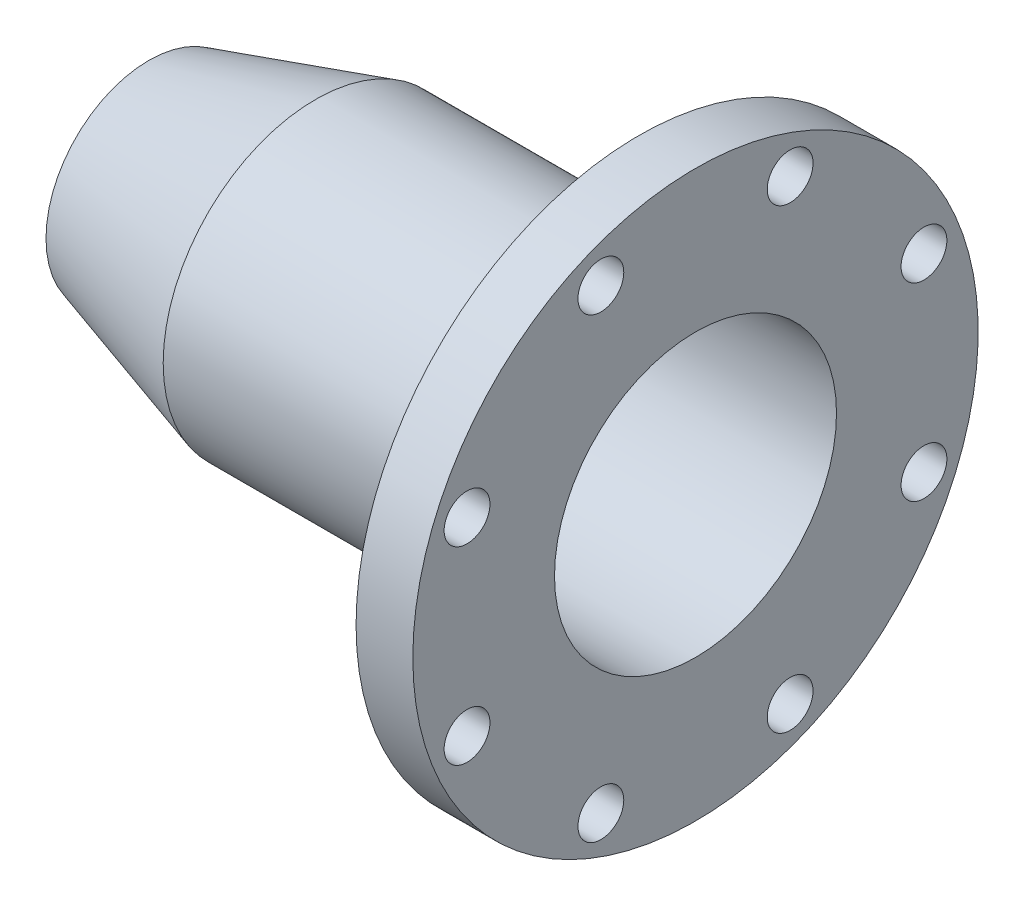
ISO-10303-21;
HEADER;
FILE_DESCRIPTION(('STEP AP214'),'2;1');
FILE_NAME('part.step','',(''),(''),'','','');
FILE_SCHEMA(('AUTOMOTIVE_DESIGN { 1 0 10303 214 1 1 1 1 }'));
ENDSEC;
DATA;
#1=APPLICATION_CONTEXT('core data for automotive mechanical design processes');
#2=APPLICATION_PROTOCOL_DEFINITION('international standard','automotive_design',2000,#1);
#3=PRODUCT_CONTEXT('',#1,'mechanical');
#4=PRODUCT('Part','Part','',(#3));
#5=PRODUCT_RELATED_PRODUCT_CATEGORY('part','',(#4));
#6=PRODUCT_DEFINITION_FORMATION('','',#4);
#7=PRODUCT_DEFINITION_CONTEXT('part definition',#1,'design');
#8=PRODUCT_DEFINITION('design','',#6,#7);
#9=PRODUCT_DEFINITION_SHAPE('','',#8);
#10=(LENGTH_UNIT() NAMED_UNIT(*) SI_UNIT(.MILLI.,.METRE.));
#11=(NAMED_UNIT(*) PLANE_ANGLE_UNIT() SI_UNIT($,.RADIAN.));
#12=(NAMED_UNIT(*) SI_UNIT($,.STERADIAN.) SOLID_ANGLE_UNIT());
#13=UNCERTAINTY_MEASURE_WITH_UNIT(LENGTH_MEASURE(1.E-05),#10,'distance_accuracy_value','');
#14=(GEOMETRIC_REPRESENTATION_CONTEXT(3) GLOBAL_UNCERTAINTY_ASSIGNED_CONTEXT((#13)) GLOBAL_UNIT_ASSIGNED_CONTEXT((#10,
#11,#12)) REPRESENTATION_CONTEXT('',''));
#15=CARTESIAN_POINT('',(0.,0.,0.));
#16=DIRECTION('',(0.,0.,1.));
#17=DIRECTION('',(1.,0.,0.));
#18=AXIS2_PLACEMENT_3D('',#15,#16,#17);
#19=CARTESIAN_POINT('',(0.,0.,0.));
#20=DIRECTION('',(-1.,0.,0.));
#21=DIRECTION('',(0.,0.,1.));
#22=AXIS2_PLACEMENT_3D('',#19,#20,#21);
#23=CYLINDRICAL_SURFACE('',#22,74.295);
#24=CARTESIAN_POINT('',(239.01,0.,0.));
#25=DIRECTION('',(-1.,0.,0.));
#26=DIRECTION('',(0.,0.,1.));
#27=AXIS2_PLACEMENT_3D('',#24,#25,#26);
#28=CIRCLE('',#27,74.295);
#29=CARTESIAN_POINT('',(239.01,0.,74.295));
#30=VERTEX_POINT('',#29);
#31=EDGE_CURVE('E98',#30,#30,#28,.T.);
#32=ORIENTED_EDGE('',*,*,#31,.T.);
#33=EDGE_LOOP('',(#32));
#34=FACE_BOUND('',#33,.T.);
#35=CARTESIAN_POINT('',(81.28,0.,0.));
#36=DIRECTION('',(-1.,0.,0.));
#37=DIRECTION('',(0.,0.,1.));
#38=AXIS2_PLACEMENT_3D('',#35,#36,#37);
#39=CIRCLE('',#38,74.295);
#40=CARTESIAN_POINT('',(81.28,0.,74.295));
#41=VERTEX_POINT('',#40);
#42=EDGE_CURVE('E10',#41,#41,#39,.T.);
#43=ORIENTED_EDGE('',*,*,#42,.F.);
#44=EDGE_LOOP('',(#43));
#45=FACE_BOUND('',#44,.T.);
#46=ADVANCED_FACE('F39',(#34,#45),#23,.T.);
#47=CARTESIAN_POINT('',(81.28,0.,0.));
#48=DIRECTION('',(1.,0.,0.));
#49=DIRECTION('',(0.,0.,-1.));
#50=AXIS2_PLACEMENT_3D('',#47,#48,#49);
#51=CONICAL_SURFACE('',#50,74.295,0.288340484549115);
#52=CARTESIAN_POINT('',(0.,0.,0.));
#53=DIRECTION('',(-1.,0.,0.));
#54=DIRECTION('',(0.,0.,1.));
#55=AXIS2_PLACEMENT_3D('',#52,#53,#54);
#56=CIRCLE('',#55,50.1868331198608);
#57=CARTESIAN_POINT('',(0.,0.,50.1868331198608));
#58=VERTEX_POINT('',#57);
#59=EDGE_CURVE('E47',#58,#58,#56,.T.);
#60=ORIENTED_EDGE('',*,*,#59,.F.);
#61=EDGE_LOOP('',(#60));
#62=FACE_BOUND('',#61,.T.);
#63=ORIENTED_EDGE('',*,*,#42,.T.);
#64=EDGE_LOOP('',(#63));
#65=FACE_BOUND('',#64,.T.);
#66=ADVANCED_FACE('F127',(#62,#65),#51,.T.);
#67=CARTESIAN_POINT('',(0.,0.,0.));
#68=DIRECTION('',(1.,0.,0.));
#69=DIRECTION('',(0.,0.,-1.));
#70=AXIS2_PLACEMENT_3D('',#67,#68,#69);
#71=PLANE('',#70);
#72=CARTESIAN_POINT('',(0.,0.,0.));
#73=DIRECTION('',(-1.,0.,0.));
#74=DIRECTION('',(0.,0.,1.));
#75=AXIS2_PLACEMENT_3D('',#72,#73,#74);
#76=CIRCLE('',#75,44.45);
#77=CARTESIAN_POINT('',(0.,0.,44.45));
#78=VERTEX_POINT('',#77);
#79=EDGE_CURVE('E53',#78,#78,#76,.T.);
#80=ORIENTED_EDGE('',*,*,#79,.F.);
#81=EDGE_LOOP('',(#80));
#82=FACE_BOUND('',#81,.T.);
#83=ORIENTED_EDGE('',*,*,#59,.T.);
#84=EDGE_LOOP('',(#83));
#85=FACE_BOUND('',#84,.T.);
#86=ADVANCED_FACE('F124',(#82,#85),#71,.F.);
#87=CARTESIAN_POINT('',(82.0784761378992,0.,0.));
#88=DIRECTION('',(1.,0.,0.));
#89=DIRECTION('',(0.,0.,-1.));
#90=AXIS2_PLACEMENT_3D('',#87,#88,#89);
#91=CONICAL_SURFACE('',#90,68.795,0.288340484549115);
#92=ORIENTED_EDGE('',*,*,#79,.T.);
#93=EDGE_LOOP('',(#92));
#94=FACE_BOUND('',#93,.T.);
#95=CARTESIAN_POINT('',(82.0784761378992,0.,0.));
#96=DIRECTION('',(-1.,0.,0.));
#97=DIRECTION('',(0.,0.,1.));
#98=AXIS2_PLACEMENT_3D('',#95,#96,#97);
#99=CIRCLE('',#98,68.795);
#100=CARTESIAN_POINT('',(82.0784761378992,0.,68.795));
#101=VERTEX_POINT('',#100);
#102=EDGE_CURVE('E114',#101,#101,#99,.T.);
#103=ORIENTED_EDGE('',*,*,#102,.F.);
#104=EDGE_LOOP('',(#103));
#105=FACE_BOUND('',#104,.T.);
#106=ADVANCED_FACE('F121',(#94,#105),#91,.F.);
#107=CARTESIAN_POINT('',(0.,0.,0.));
#108=DIRECTION('',(-1.,0.,0.));
#109=DIRECTION('',(0.,0.,1.));
#110=AXIS2_PLACEMENT_3D('',#107,#108,#109);
#111=CYLINDRICAL_SURFACE('',#110,68.795);
#112=ORIENTED_EDGE('',*,*,#102,.T.);
#113=EDGE_LOOP('',(#112));
#114=FACE_BOUND('',#113,.T.);
#115=CARTESIAN_POINT('',(266.7,0.,0.));
#116=DIRECTION('',(-1.,0.,0.));
#117=DIRECTION('',(0.,0.,1.));
#118=AXIS2_PLACEMENT_3D('',#115,#116,#117);
#119=CIRCLE('',#118,68.795);
#120=CARTESIAN_POINT('',(266.7,0.,68.795));
#121=VERTEX_POINT('',#120);
#122=EDGE_CURVE('E110',#121,#121,#119,.T.);
#123=ORIENTED_EDGE('',*,*,#122,.F.);
#124=EDGE_LOOP('',(#123));
#125=FACE_BOUND('',#124,.T.);
#126=ADVANCED_FACE('F139',(#114,#125),#111,.F.);
#127=CARTESIAN_POINT('',(266.7,2.141746695606E-13,0.));
#128=DIRECTION('',(-1.,0.,0.));
#129=DIRECTION('',(0.,0.,1.));
#130=AXIS2_PLACEMENT_3D('',#127,#128,#129);
#131=PLANE('',#130);
#132=CARTESIAN_POINT('',(266.7,46.1707561148491,111.466065597486));
#133=DIRECTION('',(1.,0.,0.));
#134=DIRECTION('',(0.,0.,-1.));
#135=AXIS2_PLACEMENT_3D('',#132,#133,#134);
#136=CIRCLE('',#135,11.176);
#137=CARTESIAN_POINT('',(266.7,46.1707561148491,100.290065597486));
#138=VERTEX_POINT('',#137);
#139=EDGE_CURVE('E190',#138,#138,#136,.T.);
#140=ORIENTED_EDGE('',*,*,#139,.F.);
#141=EDGE_LOOP('',(#140));
#142=FACE_BOUND('',#141,.T.);
#143=CARTESIAN_POINT('',(266.7,-46.1707561148473,111.466065597487));
#144=DIRECTION('',(1.,0.,0.));
#145=DIRECTION('',(0.,0.,-1.));
#146=AXIS2_PLACEMENT_3D('',#143,#144,#145);
#147=CIRCLE('',#146,11.176);
#148=CARTESIAN_POINT('',(266.7,-46.1707561148473,100.290065597487));
#149=VERTEX_POINT('',#148);
#150=EDGE_CURVE('E195',#149,#149,#147,.T.);
#151=ORIENTED_EDGE('',*,*,#150,.F.);
#152=EDGE_LOOP('',(#151));
#153=FACE_BOUND('',#152,.T.);
#154=CARTESIAN_POINT('',(266.7,-111.466065597486,46.1707561148487));
#155=DIRECTION('',(1.,0.,0.));
#156=DIRECTION('',(0.,0.,-1.));
#157=AXIS2_PLACEMENT_3D('',#154,#155,#156);
#158=CIRCLE('',#157,11.176);
#159=CARTESIAN_POINT('',(266.7,-111.466065597486,34.9947561148488));
#160=VERTEX_POINT('',#159);
#161=EDGE_CURVE('E207',#160,#160,#158,.T.);
#162=ORIENTED_EDGE('',*,*,#161,.F.);
#163=EDGE_LOOP('',(#162));
#164=FACE_BOUND('',#163,.T.);
#165=CARTESIAN_POINT('',(266.7,-111.466065597487,-46.1707561148476));
#166=DIRECTION('',(1.,0.,0.));
#167=DIRECTION('',(0.,0.,-1.));
#168=AXIS2_PLACEMENT_3D('',#165,#166,#167);
#169=CIRCLE('',#168,11.176);
#170=CARTESIAN_POINT('',(266.7,-111.466065597487,-57.3467561148475));
#171=VERTEX_POINT('',#170);
#172=EDGE_CURVE('E84',#171,#171,#169,.T.);
#173=ORIENTED_EDGE('',*,*,#172,.F.);
#174=EDGE_LOOP('',(#173));
#175=FACE_BOUND('',#174,.T.);
#176=CARTESIAN_POINT('',(266.7,-46.1707561148484,-111.466065597487));
#177=DIRECTION('',(1.,0.,0.));
#178=DIRECTION('',(0.,0.,-1.));
#179=AXIS2_PLACEMENT_3D('',#176,#177,#178);
#180=CIRCLE('',#179,11.176);
#181=CARTESIAN_POINT('',(266.7,-46.1707561148484,-122.642065597487));
#182=VERTEX_POINT('',#181);
#183=EDGE_CURVE('E70',#182,#182,#180,.T.);
#184=ORIENTED_EDGE('',*,*,#183,.F.);
#185=EDGE_LOOP('',(#184));
#186=FACE_BOUND('',#185,.T.);
#187=CARTESIAN_POINT('',(266.7,46.1707561148479,-111.466065597487));
#188=DIRECTION('',(1.,0.,0.));
#189=DIRECTION('',(0.,0.,-1.));
#190=AXIS2_PLACEMENT_3D('',#187,#188,#189);
#191=CIRCLE('',#190,11.176);
#192=CARTESIAN_POINT('',(266.7,46.1707561148479,-122.642065597487));
#193=VERTEX_POINT('',#192);
#194=EDGE_CURVE('E66',#193,#193,#191,.T.);
#195=ORIENTED_EDGE('',*,*,#194,.F.);
#196=EDGE_LOOP('',(#195));
#197=FACE_BOUND('',#196,.T.);
#198=CARTESIAN_POINT('',(266.7,111.466065597487,-46.1707561148481));
#199=DIRECTION('',(1.,0.,0.));
#200=DIRECTION('',(0.,0.,-1.));
#201=AXIS2_PLACEMENT_3D('',#198,#199,#200);
#202=CIRCLE('',#201,11.176);
#203=CARTESIAN_POINT('',(266.7,111.466065597487,-57.3467561148481));
#204=VERTEX_POINT('',#203);
#205=EDGE_CURVE('E62',#204,#204,#202,.T.);
#206=ORIENTED_EDGE('',*,*,#205,.F.);
#207=EDGE_LOOP('',(#206));
#208=FACE_BOUND('',#207,.T.);
#209=CARTESIAN_POINT('',(266.7,111.466065597487,46.1707561148482));
#210=DIRECTION('',(1.,0.,0.));
#211=DIRECTION('',(0.,0.,-1.));
#212=AXIS2_PLACEMENT_3D('',#209,#210,#211);
#213=CIRCLE('',#212,11.176);
#214=CARTESIAN_POINT('',(266.7,111.466065597487,34.9947561148482));
#215=VERTEX_POINT('',#214);
#216=EDGE_CURVE('E61',#215,#215,#213,.T.);
#217=ORIENTED_EDGE('',*,*,#216,.F.);
#218=EDGE_LOOP('',(#217));
#219=FACE_BOUND('',#218,.T.);
#220=CARTESIAN_POINT('',(266.7,0.,0.));
#221=DIRECTION('',(-1.,0.,0.));
#222=DIRECTION('',(0.,0.,1.));
#223=AXIS2_PLACEMENT_3D('',#220,#221,#222);
#224=CIRCLE('',#223,137.92);
#225=CARTESIAN_POINT('',(266.7,0.,137.92));
#226=VERTEX_POINT('',#225);
#227=EDGE_CURVE('E106',#226,#226,#224,.T.);
#228=ORIENTED_EDGE('',*,*,#227,.F.);
#229=EDGE_LOOP('',(#228));
#230=FACE_BOUND('',#229,.T.);
#231=ORIENTED_EDGE('',*,*,#122,.T.);
#232=EDGE_LOOP('',(#231));
#233=FACE_BOUND('',#232,.T.);
#234=ADVANCED_FACE('F142',(#142,#153,#164,#175,#186,#197,#208,#219,#230,#233),#131,.F.);
#235=CARTESIAN_POINT('',(0.,0.,0.));
#236=DIRECTION('',(-1.,0.,0.));
#237=DIRECTION('',(0.,0.,1.));
#238=AXIS2_PLACEMENT_3D('',#235,#236,#237);
#239=CYLINDRICAL_SURFACE('',#238,137.92);
#240=CARTESIAN_POINT('',(239.01,0.,0.));
#241=DIRECTION('',(-1.,0.,0.));
#242=DIRECTION('',(0.,0.,1.));
#243=AXIS2_PLACEMENT_3D('',#240,#241,#242);
#244=CIRCLE('',#243,137.92);
#245=CARTESIAN_POINT('',(239.01,0.,137.92));
#246=VERTEX_POINT('',#245);
#247=EDGE_CURVE('E102',#246,#246,#244,.T.);
#248=ORIENTED_EDGE('',*,*,#247,.F.);
#249=EDGE_LOOP('',(#248));
#250=FACE_BOUND('',#249,.T.);
#251=ORIENTED_EDGE('',*,*,#227,.T.);
#252=EDGE_LOOP('',(#251));
#253=FACE_BOUND('',#252,.T.);
#254=ADVANCED_FACE('F146',(#250,#253),#239,.T.);
#255=CARTESIAN_POINT('',(239.01,1.04264992186899E-13,0.));
#256=DIRECTION('',(1.,0.,0.));
#257=DIRECTION('',(0.,0.,-1.));
#258=AXIS2_PLACEMENT_3D('',#255,#256,#257);
#259=PLANE('',#258);
#260=CARTESIAN_POINT('',(239.01,46.1707561148491,111.466065597486));
#261=DIRECTION('',(1.,0.,0.));
#262=DIRECTION('',(0.,0.,-1.));
#263=AXIS2_PLACEMENT_3D('',#260,#261,#262);
#264=CIRCLE('',#263,11.176);
#265=CARTESIAN_POINT('',(239.01,46.1707561148491,100.290065597486));
#266=VERTEX_POINT('',#265);
#267=EDGE_CURVE('E193',#266,#266,#264,.T.);
#268=ORIENTED_EDGE('',*,*,#267,.T.);
#269=EDGE_LOOP('',(#268));
#270=FACE_BOUND('',#269,.T.);
#271=CARTESIAN_POINT('',(239.01,-46.1707561148473,111.466065597487));
#272=DIRECTION('',(1.,0.,0.));
#273=DIRECTION('',(0.,0.,-1.));
#274=AXIS2_PLACEMENT_3D('',#271,#272,#273);
#275=CIRCLE('',#274,11.176);
#276=CARTESIAN_POINT('',(239.01,-46.1707561148473,100.290065597487));
#277=VERTEX_POINT('',#276);
#278=EDGE_CURVE('E200',#277,#277,#275,.T.);
#279=ORIENTED_EDGE('',*,*,#278,.T.);
#280=EDGE_LOOP('',(#279));
#281=FACE_BOUND('',#280,.T.);
#282=CARTESIAN_POINT('',(239.01,-111.466065597486,46.1707561148487));
#283=DIRECTION('',(1.,0.,0.));
#284=DIRECTION('',(0.,0.,-1.));
#285=AXIS2_PLACEMENT_3D('',#282,#283,#284);
#286=CIRCLE('',#285,11.176);
#287=CARTESIAN_POINT('',(239.01,-111.466065597486,34.9947561148488));
#288=VERTEX_POINT('',#287);
#289=EDGE_CURVE('E42',#288,#288,#286,.T.);
#290=ORIENTED_EDGE('',*,*,#289,.T.);
#291=EDGE_LOOP('',(#290));
#292=FACE_BOUND('',#291,.T.);
#293=CARTESIAN_POINT('',(239.01,-111.466065597487,-46.1707561148476));
#294=DIRECTION('',(1.,0.,0.));
#295=DIRECTION('',(0.,0.,-1.));
#296=AXIS2_PLACEMENT_3D('',#293,#294,#295);
#297=CIRCLE('',#296,11.176);
#298=CARTESIAN_POINT('',(239.01,-111.466065597487,-57.3467561148475));
#299=VERTEX_POINT('',#298);
#300=EDGE_CURVE('E78',#299,#299,#297,.T.);
#301=ORIENTED_EDGE('',*,*,#300,.T.);
#302=EDGE_LOOP('',(#301));
#303=FACE_BOUND('',#302,.T.);
#304=CARTESIAN_POINT('',(239.01,-46.1707561148484,-111.466065597487));
#305=DIRECTION('',(1.,0.,0.));
#306=DIRECTION('',(0.,0.,-1.));
#307=AXIS2_PLACEMENT_3D('',#304,#305,#306);
#308=CIRCLE('',#307,11.176);
#309=CARTESIAN_POINT('',(239.01,-46.1707561148484,-122.642065597487));
#310=VERTEX_POINT('',#309);
#311=EDGE_CURVE('E67',#310,#310,#308,.T.);
#312=ORIENTED_EDGE('',*,*,#311,.T.);
#313=EDGE_LOOP('',(#312));
#314=FACE_BOUND('',#313,.T.);
#315=CARTESIAN_POINT('',(239.01,46.1707561148479,-111.466065597487));
#316=DIRECTION('',(1.,0.,0.));
#317=DIRECTION('',(0.,0.,-1.));
#318=AXIS2_PLACEMENT_3D('',#315,#316,#317);
#319=CIRCLE('',#318,11.176);
#320=CARTESIAN_POINT('',(239.01,46.1707561148479,-122.642065597487));
#321=VERTEX_POINT('',#320);
#322=EDGE_CURVE('E63',#321,#321,#319,.T.);
#323=ORIENTED_EDGE('',*,*,#322,.T.);
#324=EDGE_LOOP('',(#323));
#325=FACE_BOUND('',#324,.T.);
#326=CARTESIAN_POINT('',(239.01,111.466065597487,-46.1707561148481));
#327=DIRECTION('',(1.,0.,0.));
#328=DIRECTION('',(0.,0.,-1.));
#329=AXIS2_PLACEMENT_3D('',#326,#327,#328);
#330=CIRCLE('',#329,11.176);
#331=CARTESIAN_POINT('',(239.01,111.466065597487,-57.3467561148481));
#332=VERTEX_POINT('',#331);
#333=EDGE_CURVE('E57',#332,#332,#330,.T.);
#334=ORIENTED_EDGE('',*,*,#333,.T.);
#335=EDGE_LOOP('',(#334));
#336=FACE_BOUND('',#335,.T.);
#337=CARTESIAN_POINT('',(239.01,111.466065597487,46.1707561148482));
#338=DIRECTION('',(1.,0.,0.));
#339=DIRECTION('',(0.,0.,-1.));
#340=AXIS2_PLACEMENT_3D('',#337,#338,#339);
#341=CIRCLE('',#340,11.176);
#342=CARTESIAN_POINT('',(239.01,111.466065597487,34.9947561148482));
#343=VERTEX_POINT('',#342);
#344=EDGE_CURVE('E94',#343,#343,#341,.T.);
#345=ORIENTED_EDGE('',*,*,#344,.T.);
#346=EDGE_LOOP('',(#345));
#347=FACE_BOUND('',#346,.T.);
#348=ORIENTED_EDGE('',*,*,#31,.F.);
#349=EDGE_LOOP('',(#348));
#350=FACE_BOUND('',#349,.T.);
#351=ORIENTED_EDGE('',*,*,#247,.T.);
#352=EDGE_LOOP('',(#351));
#353=FACE_BOUND('',#352,.T.);
#354=ADVANCED_FACE('F150',(#270,#281,#292,#303,#314,#325,#336,#347,#350,#353),#259,.F.);
#355=CARTESIAN_POINT('',(266.7,111.466065597487,46.1707561148482));
#356=DIRECTION('',(1.,0.,0.));
#357=DIRECTION('',(0.,0.,-1.));
#358=AXIS2_PLACEMENT_3D('',#355,#356,#357);
#359=CYLINDRICAL_SURFACE('',#358,11.176);
#360=ORIENTED_EDGE('',*,*,#216,.T.);
#361=EDGE_LOOP('',(#360));
#362=FACE_BOUND('',#361,.T.);
#363=ORIENTED_EDGE('',*,*,#344,.F.);
#364=EDGE_LOOP('',(#363));
#365=FACE_BOUND('',#364,.T.);
#366=ADVANCED_FACE('F154',(#362,#365),#359,.F.);
#367=CARTESIAN_POINT('',(266.7,111.466065597487,-46.1707561148481));
#368=DIRECTION('',(1.,0.,0.));
#369=DIRECTION('',(0.,0.,-1.));
#370=AXIS2_PLACEMENT_3D('',#367,#368,#369);
#371=CYLINDRICAL_SURFACE('',#370,11.176);
#372=ORIENTED_EDGE('',*,*,#205,.T.);
#373=EDGE_LOOP('',(#372));
#374=FACE_BOUND('',#373,.T.);
#375=ORIENTED_EDGE('',*,*,#333,.F.);
#376=EDGE_LOOP('',(#375));
#377=FACE_BOUND('',#376,.T.);
#378=ADVANCED_FACE('F158',(#374,#377),#371,.F.);
#379=CARTESIAN_POINT('',(266.7,46.1707561148479,-111.466065597487));
#380=DIRECTION('',(1.,0.,0.));
#381=DIRECTION('',(0.,0.,-1.));
#382=AXIS2_PLACEMENT_3D('',#379,#380,#381);
#383=CYLINDRICAL_SURFACE('',#382,11.176);
#384=ORIENTED_EDGE('',*,*,#194,.T.);
#385=EDGE_LOOP('',(#384));
#386=FACE_BOUND('',#385,.T.);
#387=ORIENTED_EDGE('',*,*,#322,.F.);
#388=EDGE_LOOP('',(#387));
#389=FACE_BOUND('',#388,.T.);
#390=ADVANCED_FACE('F162',(#386,#389),#383,.F.);
#391=CARTESIAN_POINT('',(266.7,-46.1707561148484,-111.466065597487));
#392=DIRECTION('',(1.,0.,0.));
#393=DIRECTION('',(0.,0.,-1.));
#394=AXIS2_PLACEMENT_3D('',#391,#392,#393);
#395=CYLINDRICAL_SURFACE('',#394,11.176);
#396=ORIENTED_EDGE('',*,*,#183,.T.);
#397=EDGE_LOOP('',(#396));
#398=FACE_BOUND('',#397,.T.);
#399=ORIENTED_EDGE('',*,*,#311,.F.);
#400=EDGE_LOOP('',(#399));
#401=FACE_BOUND('',#400,.T.);
#402=ADVANCED_FACE('F166',(#398,#401),#395,.F.);
#403=CARTESIAN_POINT('',(266.7,-111.466065597487,-46.1707561148476));
#404=DIRECTION('',(1.,0.,0.));
#405=DIRECTION('',(0.,0.,-1.));
#406=AXIS2_PLACEMENT_3D('',#403,#404,#405);
#407=CYLINDRICAL_SURFACE('',#406,11.176);
#408=ORIENTED_EDGE('',*,*,#172,.T.);
#409=EDGE_LOOP('',(#408));
#410=FACE_BOUND('',#409,.T.);
#411=ORIENTED_EDGE('',*,*,#300,.F.);
#412=EDGE_LOOP('',(#411));
#413=FACE_BOUND('',#412,.T.);
#414=ADVANCED_FACE('F170',(#410,#413),#407,.F.);
#415=CARTESIAN_POINT('',(266.7,-111.466065597486,46.1707561148487));
#416=DIRECTION('',(1.,0.,0.));
#417=DIRECTION('',(0.,0.,-1.));
#418=AXIS2_PLACEMENT_3D('',#415,#416,#417);
#419=CYLINDRICAL_SURFACE('',#418,11.176);
#420=ORIENTED_EDGE('',*,*,#161,.T.);
#421=EDGE_LOOP('',(#420));
#422=FACE_BOUND('',#421,.T.);
#423=ORIENTED_EDGE('',*,*,#289,.F.);
#424=EDGE_LOOP('',(#423));
#425=FACE_BOUND('',#424,.T.);
#426=ADVANCED_FACE('F173',(#422,#425),#419,.F.);
#427=CARTESIAN_POINT('',(266.7,-46.1707561148473,111.466065597487));
#428=DIRECTION('',(1.,0.,0.));
#429=DIRECTION('',(0.,0.,-1.));
#430=AXIS2_PLACEMENT_3D('',#427,#428,#429);
#431=CYLINDRICAL_SURFACE('',#430,11.176);
#432=ORIENTED_EDGE('',*,*,#150,.T.);
#433=EDGE_LOOP('',(#432));
#434=FACE_BOUND('',#433,.T.);
#435=ORIENTED_EDGE('',*,*,#278,.F.);
#436=EDGE_LOOP('',(#435));
#437=FACE_BOUND('',#436,.T.);
#438=ADVANCED_FACE('F177',(#434,#437),#431,.F.);
#439=CARTESIAN_POINT('',(266.7,46.1707561148491,111.466065597486));
#440=DIRECTION('',(1.,0.,0.));
#441=DIRECTION('',(0.,0.,-1.));
#442=AXIS2_PLACEMENT_3D('',#439,#440,#441);
#443=CYLINDRICAL_SURFACE('',#442,11.176);
#444=ORIENTED_EDGE('',*,*,#139,.T.);
#445=EDGE_LOOP('',(#444));
#446=FACE_BOUND('',#445,.T.);
#447=ORIENTED_EDGE('',*,*,#267,.F.);
#448=EDGE_LOOP('',(#447));
#449=FACE_BOUND('',#448,.T.);
#450=ADVANCED_FACE('F181',(#446,#449),#443,.F.);
#451=CLOSED_SHELL('',(#46,#66,#86,#106,#126,#234,#254,#354,#366,#378,#390,#402,#414,#426,#438,#450));
#452=MANIFOLD_SOLID_BREP('B2',#451);
#453=ADVANCED_BREP_SHAPE_REPRESENTATION('',(#18,#452),#14);
#454=SHAPE_DEFINITION_REPRESENTATION(#9,#453);
ENDSEC;
END-ISO-10303-21;
